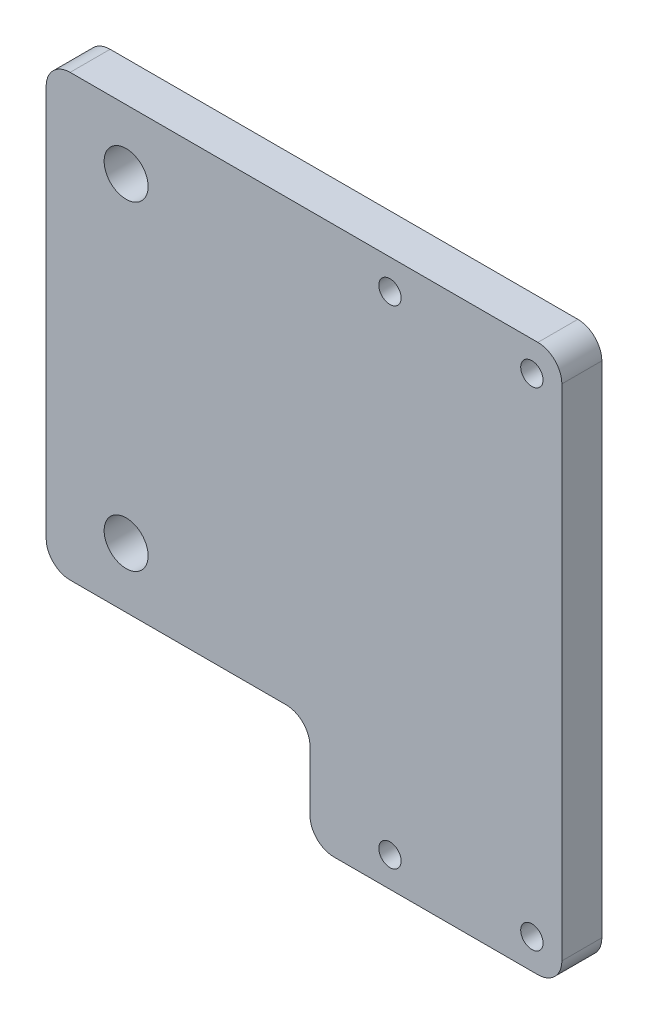
ISO-10303-21;
HEADER;
FILE_DESCRIPTION(('STEP AP214'),'2;1');
FILE_NAME('part.step','',(''),(''),'','','');
FILE_SCHEMA(('AUTOMOTIVE_DESIGN { 1 0 10303 214 1 1 1 1 }'));
ENDSEC;
DATA;
#1=APPLICATION_CONTEXT('core data for automotive mechanical design processes');
#2=APPLICATION_PROTOCOL_DEFINITION('international standard','automotive_design',2000,#1);
#3=PRODUCT_CONTEXT('',#1,'mechanical');
#4=PRODUCT('Part','Part','',(#3));
#5=PRODUCT_RELATED_PRODUCT_CATEGORY('part','',(#4));
#6=PRODUCT_DEFINITION_FORMATION('','',#4);
#7=PRODUCT_DEFINITION_CONTEXT('part definition',#1,'design');
#8=PRODUCT_DEFINITION('design','',#6,#7);
#9=PRODUCT_DEFINITION_SHAPE('','',#8);
#10=(LENGTH_UNIT() NAMED_UNIT(*) SI_UNIT(.MILLI.,.METRE.));
#11=(NAMED_UNIT(*) PLANE_ANGLE_UNIT() SI_UNIT($,.RADIAN.));
#12=(NAMED_UNIT(*) SI_UNIT($,.STERADIAN.) SOLID_ANGLE_UNIT());
#13=UNCERTAINTY_MEASURE_WITH_UNIT(LENGTH_MEASURE(1.E-05),#10,'distance_accuracy_value','');
#14=(GEOMETRIC_REPRESENTATION_CONTEXT(3) GLOBAL_UNCERTAINTY_ASSIGNED_CONTEXT((#13)) GLOBAL_UNIT_ASSIGNED_CONTEXT((#10,
#11,#12)) REPRESENTATION_CONTEXT('',''));
#15=CARTESIAN_POINT('',(0.,0.,0.));
#16=DIRECTION('',(0.,0.,1.));
#17=DIRECTION('',(1.,0.,0.));
#18=AXIS2_PLACEMENT_3D('',#15,#16,#17);
#19=CARTESIAN_POINT('',(-33.,27.5,5.));
#20=DIRECTION('',(1.,0.,0.));
#21=DIRECTION('',(0.,0.,-1.));
#22=AXIS2_PLACEMENT_3D('',#19,#20,#21);
#23=PLANE('',#22);
#24=DIRECTION('',(0.,-1.,0.));
#25=VECTOR('',#24,1.);
#26=CARTESIAN_POINT('',(-33.,27.5,0.));
#27=LINE('',#26,#25);
#28=CARTESIAN_POINT('',(-33.,24.5,0.));
#29=VERTEX_POINT('',#28);
#30=CARTESIAN_POINT('',(-33.,-24.5,0.));
#31=VERTEX_POINT('',#30);
#32=EDGE_CURVE('E208',#29,#31,#27,.T.);
#33=ORIENTED_EDGE('',*,*,#32,.T.);
#34=DIRECTION('',(0.,0.,-1.));
#35=VECTOR('',#34,1.);
#36=CARTESIAN_POINT('',(-33.,-24.5,5.));
#37=LINE('',#36,#35);
#38=CARTESIAN_POINT('',(-33.,-24.5,5.));
#39=VERTEX_POINT('',#38);
#40=EDGE_CURVE('E193',#31,#39,#37,.F.);
#41=ORIENTED_EDGE('',*,*,#40,.T.);
#42=DIRECTION('',(0.,-1.,0.));
#43=VECTOR('',#42,1.);
#44=CARTESIAN_POINT('',(-33.,27.5,5.));
#45=LINE('',#44,#43);
#46=CARTESIAN_POINT('',(-33.,24.5,5.));
#47=VERTEX_POINT('',#46);
#48=EDGE_CURVE('E150',#47,#39,#45,.T.);
#49=ORIENTED_EDGE('',*,*,#48,.F.);
#50=DIRECTION('',(0.,0.,-1.));
#51=VECTOR('',#50,1.);
#52=CARTESIAN_POINT('',(-33.,24.5,5.));
#53=LINE('',#52,#51);
#54=EDGE_CURVE('E190',#47,#29,#53,.T.);
#55=ORIENTED_EDGE('',*,*,#54,.T.);
#56=EDGE_LOOP('',(#33,#41,#49,#55));
#57=FACE_BOUND('',#56,.T.);
#58=ADVANCED_FACE('F32',(#57),#23,.F.);
#59=CARTESIAN_POINT('',(-33.,-27.5,5.));
#60=DIRECTION('',(0.,1.,0.));
#61=DIRECTION('',(-1.,0.,0.));
#62=AXIS2_PLACEMENT_3D('',#59,#60,#61);
#63=PLANE('',#62);
#64=DIRECTION('',(1.,0.,0.));
#65=VECTOR('',#64,1.);
#66=CARTESIAN_POINT('',(-33.,-27.5,0.));
#67=LINE('',#66,#65);
#68=CARTESIAN_POINT('',(-30.,-27.5,0.));
#69=VERTEX_POINT('',#68);
#70=CARTESIAN_POINT('',(-3.,-27.5,0.));
#71=VERTEX_POINT('',#70);
#72=EDGE_CURVE('E197',#69,#71,#67,.T.);
#73=ORIENTED_EDGE('',*,*,#72,.T.);
#74=DIRECTION('',(0.,0.,-1.));
#75=VECTOR('',#74,1.);
#76=CARTESIAN_POINT('',(-3.,-27.5,5.));
#77=LINE('',#76,#75);
#78=CARTESIAN_POINT('',(-3.,-27.5,5.));
#79=VERTEX_POINT('',#78);
#80=EDGE_CURVE('E188',#71,#79,#77,.F.);
#81=ORIENTED_EDGE('',*,*,#80,.T.);
#82=DIRECTION('',(1.,0.,0.));
#83=VECTOR('',#82,1.);
#84=CARTESIAN_POINT('',(-33.,-27.5,5.));
#85=LINE('',#84,#83);
#86=CARTESIAN_POINT('',(-30.,-27.5,5.));
#87=VERTEX_POINT('',#86);
#88=EDGE_CURVE('E216',#87,#79,#85,.T.);
#89=ORIENTED_EDGE('',*,*,#88,.F.);
#90=DIRECTION('',(0.,0.,-1.));
#91=VECTOR('',#90,1.);
#92=CARTESIAN_POINT('',(-30.,-27.5,5.));
#93=LINE('',#92,#91);
#94=EDGE_CURVE('E185',#87,#69,#93,.T.);
#95=ORIENTED_EDGE('',*,*,#94,.T.);
#96=EDGE_LOOP('',(#73,#81,#89,#95));
#97=FACE_BOUND('',#96,.T.);
#98=ADVANCED_FACE('F204',(#97),#63,.F.);
#99=CARTESIAN_POINT('',(0.,-27.5,5.));
#100=DIRECTION('',(1.,0.,0.));
#101=DIRECTION('',(0.,1.,0.));
#102=AXIS2_PLACEMENT_3D('',#99,#100,#101);
#103=PLANE('',#102);
#104=DIRECTION('',(0.,-1.,0.));
#105=VECTOR('',#104,1.);
#106=CARTESIAN_POINT('',(0.,-27.5,0.));
#107=LINE('',#106,#105);
#108=CARTESIAN_POINT('',(0.,-30.5,0.));
#109=VERTEX_POINT('',#108);
#110=CARTESIAN_POINT('',(0.,-37.995,0.));
#111=VERTEX_POINT('',#110);
#112=EDGE_CURVE('E199',#109,#111,#107,.T.);
#113=ORIENTED_EDGE('',*,*,#112,.T.);
#114=DIRECTION('',(0.,0.,-1.));
#115=VECTOR('',#114,1.);
#116=CARTESIAN_POINT('',(0.,-37.995,5.));
#117=LINE('',#116,#115);
#118=CARTESIAN_POINT('',(0.,-37.995,5.));
#119=VERTEX_POINT('',#118);
#120=EDGE_CURVE('E183',#111,#119,#117,.F.);
#121=ORIENTED_EDGE('',*,*,#120,.T.);
#122=DIRECTION('',(0.,-1.,0.));
#123=VECTOR('',#122,1.);
#124=CARTESIAN_POINT('',(0.,-27.5,5.));
#125=LINE('',#124,#123);
#126=CARTESIAN_POINT('',(0.,-30.5,5.));
#127=VERTEX_POINT('',#126);
#128=EDGE_CURVE('E215',#127,#119,#125,.T.);
#129=ORIENTED_EDGE('',*,*,#128,.F.);
#130=DIRECTION('',(0.,0.,-1.));
#131=VECTOR('',#130,1.);
#132=CARTESIAN_POINT('',(0.,-30.5,0.));
#133=LINE('',#132,#131);
#134=EDGE_CURVE('E180',#127,#109,#133,.T.);
#135=ORIENTED_EDGE('',*,*,#134,.T.);
#136=EDGE_LOOP('',(#113,#121,#129,#135));
#137=FACE_BOUND('',#136,.T.);
#138=ADVANCED_FACE('F218',(#137),#103,.F.);
#139=CARTESIAN_POINT('',(31.5,-40.995,5.));
#140=DIRECTION('',(0.,1.,0.));
#141=DIRECTION('',(0.,0.,1.));
#142=AXIS2_PLACEMENT_3D('',#139,#140,#141);
#143=PLANE('',#142);
#144=DIRECTION('',(1.,0.,0.));
#145=VECTOR('',#144,1.);
#146=CARTESIAN_POINT('',(31.5,-40.995,0.));
#147=LINE('',#146,#145);
#148=CARTESIAN_POINT('',(3.,-40.995,0.));
#149=VERTEX_POINT('',#148);
#150=CARTESIAN_POINT('',(28.5,-40.995,0.));
#151=VERTEX_POINT('',#150);
#152=EDGE_CURVE('E152',#149,#151,#147,.T.);
#153=ORIENTED_EDGE('',*,*,#152,.T.);
#154=DIRECTION('',(0.,0.,-1.));
#155=VECTOR('',#154,1.);
#156=CARTESIAN_POINT('',(28.5,-40.995,5.));
#157=LINE('',#156,#155);
#158=CARTESIAN_POINT('',(28.5,-40.995,5.));
#159=VERTEX_POINT('',#158);
#160=EDGE_CURVE('E47',#151,#159,#157,.F.);
#161=ORIENTED_EDGE('',*,*,#160,.T.);
#162=DIRECTION('',(1.,0.,0.));
#163=VECTOR('',#162,1.);
#164=CARTESIAN_POINT('',(0.,-40.995,5.));
#165=LINE('',#164,#163);
#166=CARTESIAN_POINT('',(3.,-40.995,5.));
#167=VERTEX_POINT('',#166);
#168=EDGE_CURVE('E220',#167,#159,#165,.T.);
#169=ORIENTED_EDGE('',*,*,#168,.F.);
#170=DIRECTION('',(0.,0.,-1.));
#171=VECTOR('',#170,1.);
#172=CARTESIAN_POINT('',(3.,-40.995,5.));
#173=LINE('',#172,#171);
#174=EDGE_CURVE('E176',#167,#149,#173,.T.);
#175=ORIENTED_EDGE('',*,*,#174,.T.);
#176=EDGE_LOOP('',(#153,#161,#169,#175));
#177=FACE_BOUND('',#176,.T.);
#178=ADVANCED_FACE('F231',(#177),#143,.F.);
#179=CARTESIAN_POINT('',(31.5,27.5,5.));
#180=DIRECTION('',(-1.,0.,0.));
#181=DIRECTION('',(0.,0.,1.));
#182=AXIS2_PLACEMENT_3D('',#179,#180,#181);
#183=PLANE('',#182);
#184=DIRECTION('',(0.,1.,0.));
#185=VECTOR('',#184,1.);
#186=CARTESIAN_POINT('',(31.5,27.5,0.));
#187=LINE('',#186,#185);
#188=CARTESIAN_POINT('',(31.5,-37.995,0.));
#189=VERTEX_POINT('',#188);
#190=CARTESIAN_POINT('',(31.5,24.5,0.));
#191=VERTEX_POINT('',#190);
#192=EDGE_CURVE('E148',#189,#191,#187,.T.);
#193=ORIENTED_EDGE('',*,*,#192,.T.);
#194=DIRECTION('',(0.,0.,-1.));
#195=VECTOR('',#194,1.);
#196=CARTESIAN_POINT('',(31.5,24.5,5.));
#197=LINE('',#196,#195);
#198=CARTESIAN_POINT('',(31.5,24.5,5.));
#199=VERTEX_POINT('',#198);
#200=EDGE_CURVE('E127',#191,#199,#197,.F.);
#201=ORIENTED_EDGE('',*,*,#200,.T.);
#202=DIRECTION('',(0.,1.,0.));
#203=VECTOR('',#202,1.);
#204=CARTESIAN_POINT('',(31.5,27.5,5.));
#205=LINE('',#204,#203);
#206=CARTESIAN_POINT('',(31.5,-37.995,5.));
#207=VERTEX_POINT('',#206);
#208=EDGE_CURVE('E156',#207,#199,#205,.T.);
#209=ORIENTED_EDGE('',*,*,#208,.F.);
#210=DIRECTION('',(0.,0.,-1.));
#211=VECTOR('',#210,1.);
#212=CARTESIAN_POINT('',(31.5,-37.995,5.));
#213=LINE('',#212,#211);
#214=EDGE_CURVE('E132',#207,#189,#213,.T.);
#215=ORIENTED_EDGE('',*,*,#214,.T.);
#216=EDGE_LOOP('',(#193,#201,#209,#215));
#217=FACE_BOUND('',#216,.T.);
#218=ADVANCED_FACE('F239',(#217),#183,.F.);
#219=CARTESIAN_POINT('',(24.,27.5,5.));
#220=DIRECTION('',(0.,-1.,0.));
#221=DIRECTION('',(0.,0.,-1.));
#222=AXIS2_PLACEMENT_3D('',#219,#220,#221);
#223=PLANE('',#222);
#224=DIRECTION('',(-1.,0.,0.));
#225=VECTOR('',#224,1.);
#226=CARTESIAN_POINT('',(0.,27.5,5.));
#227=LINE('',#226,#225);
#228=CARTESIAN_POINT('',(28.5,27.5,5.));
#229=VERTEX_POINT('',#228);
#230=CARTESIAN_POINT('',(-30.,27.5,5.));
#231=VERTEX_POINT('',#230);
#232=EDGE_CURVE('E142',#229,#231,#227,.T.);
#233=ORIENTED_EDGE('',*,*,#232,.F.);
#234=DIRECTION('',(0.,0.,-1.));
#235=VECTOR('',#234,1.);
#236=CARTESIAN_POINT('',(28.5,27.5,5.));
#237=LINE('',#236,#235);
#238=CARTESIAN_POINT('',(28.5,27.5,0.));
#239=VERTEX_POINT('',#238);
#240=EDGE_CURVE('E126',#229,#239,#237,.T.);
#241=ORIENTED_EDGE('',*,*,#240,.T.);
#242=DIRECTION('',(-1.,0.,0.));
#243=VECTOR('',#242,1.);
#244=CARTESIAN_POINT('',(24.,27.5,0.));
#245=LINE('',#244,#243);
#246=CARTESIAN_POINT('',(-30.,27.5,0.));
#247=VERTEX_POINT('',#246);
#248=EDGE_CURVE('E139',#239,#247,#245,.T.);
#249=ORIENTED_EDGE('',*,*,#248,.T.);
#250=DIRECTION('',(0.,0.,-1.));
#251=VECTOR('',#250,1.);
#252=CARTESIAN_POINT('',(-30.,27.5,5.));
#253=LINE('',#252,#251);
#254=EDGE_CURVE('E144',#247,#231,#253,.F.);
#255=ORIENTED_EDGE('',*,*,#254,.T.);
#256=EDGE_LOOP('',(#233,#241,#249,#255));
#257=FACE_BOUND('',#256,.T.);
#258=ADVANCED_FACE('F138',(#257),#223,.F.);
#259=CARTESIAN_POINT('',(0.,0.,5.));
#260=DIRECTION('',(0.,0.,-1.));
#261=DIRECTION('',(-1.,0.,0.));
#262=AXIS2_PLACEMENT_3D('',#259,#260,#261);
#263=PLANE('',#262);
#264=CARTESIAN_POINT('',(10.,23.75,5.));
#265=DIRECTION('',(0.,0.,1.));
#266=DIRECTION('',(1.,0.,0.));
#267=AXIS2_PLACEMENT_3D('',#264,#265,#266);
#268=CIRCLE('',#267,1.397);
#269=CARTESIAN_POINT('',(11.397,23.75,5.));
#270=VERTEX_POINT('',#269);
#271=EDGE_CURVE('E314',#270,#270,#268,.T.);
#272=ORIENTED_EDGE('',*,*,#271,.F.);
#273=EDGE_LOOP('',(#272));
#274=FACE_BOUND('',#273,.T.);
#275=CARTESIAN_POINT('',(27.75,23.75,5.));
#276=DIRECTION('',(0.,0.,1.));
#277=DIRECTION('',(1.,0.,0.));
#278=AXIS2_PLACEMENT_3D('',#275,#276,#277);
#279=CIRCLE('',#278,1.397);
#280=CARTESIAN_POINT('',(29.147,23.75,5.));
#281=VERTEX_POINT('',#280);
#282=EDGE_CURVE('E308',#281,#281,#279,.T.);
#283=ORIENTED_EDGE('',*,*,#282,.F.);
#284=EDGE_LOOP('',(#283));
#285=FACE_BOUND('',#284,.T.);
#286=CARTESIAN_POINT('',(27.75,-37.245,5.));
#287=DIRECTION('',(0.,0.,1.));
#288=DIRECTION('',(1.,0.,0.));
#289=AXIS2_PLACEMENT_3D('',#286,#287,#288);
#290=CIRCLE('',#289,1.397);
#291=CARTESIAN_POINT('',(29.147,-37.245,5.));
#292=VERTEX_POINT('',#291);
#293=EDGE_CURVE('E302',#292,#292,#290,.T.);
#294=ORIENTED_EDGE('',*,*,#293,.F.);
#295=EDGE_LOOP('',(#294));
#296=FACE_BOUND('',#295,.T.);
#297=CARTESIAN_POINT('',(10.,-37.245,5.));
#298=DIRECTION('',(0.,0.,1.));
#299=DIRECTION('',(1.,0.,0.));
#300=AXIS2_PLACEMENT_3D('',#297,#298,#299);
#301=CIRCLE('',#300,1.397);
#302=CARTESIAN_POINT('',(11.397,-37.245,5.));
#303=VERTEX_POINT('',#302);
#304=EDGE_CURVE('E296',#303,#303,#301,.T.);
#305=ORIENTED_EDGE('',*,*,#304,.F.);
#306=EDGE_LOOP('',(#305));
#307=FACE_BOUND('',#306,.T.);
#308=CARTESIAN_POINT('',(-23.,-20.,5.));
#309=DIRECTION('',(0.,0.,-1.));
#310=DIRECTION('',(-1.,0.,0.));
#311=AXIS2_PLACEMENT_3D('',#308,#309,#310);
#312=CIRCLE('',#311,2.75);
#313=CARTESIAN_POINT('',(-25.75,-20.,5.));
#314=VERTEX_POINT('',#313);
#315=EDGE_CURVE('E287',#314,#314,#312,.T.);
#316=ORIENTED_EDGE('',*,*,#315,.T.);
#317=EDGE_LOOP('',(#316));
#318=FACE_BOUND('',#317,.T.);
#319=CARTESIAN_POINT('',(-23.,20.,5.));
#320=DIRECTION('',(0.,0.,-1.));
#321=DIRECTION('',(-1.,0.,0.));
#322=AXIS2_PLACEMENT_3D('',#319,#320,#321);
#323=CIRCLE('',#322,2.75);
#324=CARTESIAN_POINT('',(-25.75,20.,5.));
#325=VERTEX_POINT('',#324);
#326=EDGE_CURVE('E228',#325,#325,#323,.T.);
#327=ORIENTED_EDGE('',*,*,#326,.T.);
#328=EDGE_LOOP('',(#327));
#329=FACE_BOUND('',#328,.T.);
#330=ORIENTED_EDGE('',*,*,#208,.T.);
#331=CARTESIAN_POINT('',(28.5,24.5,5.));
#332=DIRECTION('',(0.,0.,-1.));
#333=DIRECTION('',(-1.,0.,0.));
#334=AXIS2_PLACEMENT_3D('',#331,#332,#333);
#335=CIRCLE('',#334,3.);
#336=EDGE_CURVE('E174',#199,#229,#335,.F.);
#337=ORIENTED_EDGE('',*,*,#336,.T.);
#338=ORIENTED_EDGE('',*,*,#232,.T.);
#339=CARTESIAN_POINT('',(-30.,24.5,5.));
#340=DIRECTION('',(0.,0.,-1.));
#341=DIRECTION('',(-1.,0.,0.));
#342=AXIS2_PLACEMENT_3D('',#339,#340,#341);
#343=CIRCLE('',#342,3.);
#344=EDGE_CURVE('E167',#231,#47,#343,.F.);
#345=ORIENTED_EDGE('',*,*,#344,.T.);
#346=ORIENTED_EDGE('',*,*,#48,.T.);
#347=CARTESIAN_POINT('',(-30.,-24.5,5.));
#348=DIRECTION('',(0.,0.,-1.));
#349=DIRECTION('',(-1.,0.,0.));
#350=AXIS2_PLACEMENT_3D('',#347,#348,#349);
#351=CIRCLE('',#350,3.);
#352=EDGE_CURVE('E169',#39,#87,#351,.F.);
#353=ORIENTED_EDGE('',*,*,#352,.T.);
#354=ORIENTED_EDGE('',*,*,#88,.T.);
#355=CARTESIAN_POINT('',(-3.,-30.5,5.));
#356=DIRECTION('',(0.,0.,-1.));
#357=DIRECTION('',(-1.,0.,0.));
#358=AXIS2_PLACEMENT_3D('',#355,#356,#357);
#359=CIRCLE('',#358,3.);
#360=EDGE_CURVE('E11',#79,#127,#359,.T.);
#361=ORIENTED_EDGE('',*,*,#360,.T.);
#362=ORIENTED_EDGE('',*,*,#128,.T.);
#363=CARTESIAN_POINT('',(3.,-37.995,5.));
#364=DIRECTION('',(0.,0.,-1.));
#365=DIRECTION('',(-1.,0.,0.));
#366=AXIS2_PLACEMENT_3D('',#363,#364,#365);
#367=CIRCLE('',#366,3.);
#368=EDGE_CURVE('E54',#119,#167,#367,.F.);
#369=ORIENTED_EDGE('',*,*,#368,.T.);
#370=ORIENTED_EDGE('',*,*,#168,.T.);
#371=CARTESIAN_POINT('',(28.5,-37.995,5.));
#372=DIRECTION('',(0.,0.,-1.));
#373=DIRECTION('',(-1.,0.,0.));
#374=AXIS2_PLACEMENT_3D('',#371,#372,#373);
#375=CIRCLE('',#374,3.);
#376=EDGE_CURVE('E172',#159,#207,#375,.F.);
#377=ORIENTED_EDGE('',*,*,#376,.T.);
#378=EDGE_LOOP('',(#330,#337,#338,#345,#346,#353,#354,#361,#362,#369,#370,#377));
#379=FACE_BOUND('',#378,.T.);
#380=ADVANCED_FACE('F214',(#274,#285,#296,#307,#318,#329,#379),#263,.F.);
#381=CARTESIAN_POINT('',(0.,0.,0.));
#382=DIRECTION('',(0.,0.,-1.));
#383=DIRECTION('',(-1.,0.,0.));
#384=AXIS2_PLACEMENT_3D('',#381,#382,#383);
#385=PLANE('',#384);
#386=CARTESIAN_POINT('',(10.,23.75,0.));
#387=DIRECTION('',(0.,0.,1.));
#388=DIRECTION('',(1.,0.,0.));
#389=AXIS2_PLACEMENT_3D('',#386,#387,#388);
#390=CIRCLE('',#389,1.397);
#391=CARTESIAN_POINT('',(11.397,23.75,0.));
#392=VERTEX_POINT('',#391);
#393=EDGE_CURVE('E311',#392,#392,#390,.T.);
#394=ORIENTED_EDGE('',*,*,#393,.T.);
#395=EDGE_LOOP('',(#394));
#396=FACE_BOUND('',#395,.T.);
#397=CARTESIAN_POINT('',(27.75,23.75,0.));
#398=DIRECTION('',(0.,0.,1.));
#399=DIRECTION('',(1.,0.,0.));
#400=AXIS2_PLACEMENT_3D('',#397,#398,#399);
#401=CIRCLE('',#400,1.397);
#402=CARTESIAN_POINT('',(29.147,23.75,0.));
#403=VERTEX_POINT('',#402);
#404=EDGE_CURVE('E305',#403,#403,#401,.T.);
#405=ORIENTED_EDGE('',*,*,#404,.T.);
#406=EDGE_LOOP('',(#405));
#407=FACE_BOUND('',#406,.T.);
#408=CARTESIAN_POINT('',(27.75,-37.245,0.));
#409=DIRECTION('',(0.,0.,1.));
#410=DIRECTION('',(1.,0.,0.));
#411=AXIS2_PLACEMENT_3D('',#408,#409,#410);
#412=CIRCLE('',#411,1.397);
#413=CARTESIAN_POINT('',(29.147,-37.245,0.));
#414=VERTEX_POINT('',#413);
#415=EDGE_CURVE('E299',#414,#414,#412,.T.);
#416=ORIENTED_EDGE('',*,*,#415,.T.);
#417=EDGE_LOOP('',(#416));
#418=FACE_BOUND('',#417,.T.);
#419=CARTESIAN_POINT('',(10.,-37.245,0.));
#420=DIRECTION('',(0.,0.,1.));
#421=DIRECTION('',(1.,0.,0.));
#422=AXIS2_PLACEMENT_3D('',#419,#420,#421);
#423=CIRCLE('',#422,1.397);
#424=CARTESIAN_POINT('',(11.397,-37.245,0.));
#425=VERTEX_POINT('',#424);
#426=EDGE_CURVE('E293',#425,#425,#423,.T.);
#427=ORIENTED_EDGE('',*,*,#426,.T.);
#428=EDGE_LOOP('',(#427));
#429=FACE_BOUND('',#428,.T.);
#430=CARTESIAN_POINT('',(-23.,-20.,0.));
#431=DIRECTION('',(0.,0.,-1.));
#432=DIRECTION('',(-1.,0.,0.));
#433=AXIS2_PLACEMENT_3D('',#430,#431,#432);
#434=CIRCLE('',#433,2.75);
#435=CARTESIAN_POINT('',(-25.75,-20.,0.));
#436=VERTEX_POINT('',#435);
#437=EDGE_CURVE('E290',#436,#436,#434,.T.);
#438=ORIENTED_EDGE('',*,*,#437,.F.);
#439=EDGE_LOOP('',(#438));
#440=FACE_BOUND('',#439,.T.);
#441=CARTESIAN_POINT('',(-23.,20.,0.));
#442=DIRECTION('',(0.,0.,-1.));
#443=DIRECTION('',(-1.,0.,0.));
#444=AXIS2_PLACEMENT_3D('',#441,#442,#443);
#445=CIRCLE('',#444,2.75);
#446=CARTESIAN_POINT('',(-25.75,20.,0.));
#447=VERTEX_POINT('',#446);
#448=EDGE_CURVE('E284',#447,#447,#445,.T.);
#449=ORIENTED_EDGE('',*,*,#448,.F.);
#450=EDGE_LOOP('',(#449));
#451=FACE_BOUND('',#450,.T.);
#452=ORIENTED_EDGE('',*,*,#248,.F.);
#453=CARTESIAN_POINT('',(28.5,24.5,0.));
#454=DIRECTION('',(0.,0.,-1.));
#455=DIRECTION('',(-1.,0.,0.));
#456=AXIS2_PLACEMENT_3D('',#453,#454,#455);
#457=CIRCLE('',#456,3.);
#458=EDGE_CURVE('E122',#239,#191,#457,.T.);
#459=ORIENTED_EDGE('',*,*,#458,.T.);
#460=ORIENTED_EDGE('',*,*,#192,.F.);
#461=CARTESIAN_POINT('',(28.5,-37.995,0.));
#462=DIRECTION('',(0.,0.,-1.));
#463=DIRECTION('',(-1.,0.,0.));
#464=AXIS2_PLACEMENT_3D('',#461,#462,#463);
#465=CIRCLE('',#464,3.);
#466=EDGE_CURVE('E133',#189,#151,#465,.T.);
#467=ORIENTED_EDGE('',*,*,#466,.T.);
#468=ORIENTED_EDGE('',*,*,#152,.F.);
#469=CARTESIAN_POINT('',(3.,-37.995,0.));
#470=DIRECTION('',(0.,0.,-1.));
#471=DIRECTION('',(-1.,0.,0.));
#472=AXIS2_PLACEMENT_3D('',#469,#470,#471);
#473=CIRCLE('',#472,3.);
#474=EDGE_CURVE('E161',#149,#111,#473,.T.);
#475=ORIENTED_EDGE('',*,*,#474,.T.);
#476=ORIENTED_EDGE('',*,*,#112,.F.);
#477=CARTESIAN_POINT('',(-3.,-30.5,0.));
#478=DIRECTION('',(0.,0.,-1.));
#479=DIRECTION('',(-1.,0.,0.));
#480=AXIS2_PLACEMENT_3D('',#477,#478,#479);
#481=CIRCLE('',#480,3.);
#482=EDGE_CURVE('E40',#109,#71,#481,.F.);
#483=ORIENTED_EDGE('',*,*,#482,.T.);
#484=ORIENTED_EDGE('',*,*,#72,.F.);
#485=CARTESIAN_POINT('',(-30.,-24.5,0.));
#486=DIRECTION('',(0.,0.,-1.));
#487=DIRECTION('',(-1.,0.,0.));
#488=AXIS2_PLACEMENT_3D('',#485,#486,#487);
#489=CIRCLE('',#488,3.);
#490=EDGE_CURVE('E159',#69,#31,#489,.T.);
#491=ORIENTED_EDGE('',*,*,#490,.T.);
#492=ORIENTED_EDGE('',*,*,#32,.F.);
#493=CARTESIAN_POINT('',(-30.,24.5,0.));
#494=DIRECTION('',(0.,0.,-1.));
#495=DIRECTION('',(-1.,0.,0.));
#496=AXIS2_PLACEMENT_3D('',#493,#494,#495);
#497=CIRCLE('',#496,3.);
#498=EDGE_CURVE('E143',#29,#247,#497,.T.);
#499=ORIENTED_EDGE('',*,*,#498,.T.);
#500=EDGE_LOOP('',(#452,#459,#460,#467,#468,#475,#476,#483,#484,#491,#492,#499));
#501=FACE_BOUND('',#500,.T.);
#502=ADVANCED_FACE('F146',(#396,#407,#418,#429,#440,#451,#501),#385,.T.);
#503=CARTESIAN_POINT('',(-23.,20.,0.));
#504=DIRECTION('',(0.,0.,-1.));
#505=DIRECTION('',(-1.,0.,0.));
#506=AXIS2_PLACEMENT_3D('',#503,#504,#505);
#507=CYLINDRICAL_SURFACE('',#506,2.75);
#508=ORIENTED_EDGE('',*,*,#326,.F.);
#509=EDGE_LOOP('',(#508));
#510=FACE_BOUND('',#509,.T.);
#511=ORIENTED_EDGE('',*,*,#448,.T.);
#512=EDGE_LOOP('',(#511));
#513=FACE_BOUND('',#512,.T.);
#514=ADVANCED_FACE('F333',(#510,#513),#507,.F.);
#515=CARTESIAN_POINT('',(-23.,-20.,0.));
#516=DIRECTION('',(0.,0.,-1.));
#517=DIRECTION('',(-1.,0.,0.));
#518=AXIS2_PLACEMENT_3D('',#515,#516,#517);
#519=CYLINDRICAL_SURFACE('',#518,2.75);
#520=ORIENTED_EDGE('',*,*,#315,.F.);
#521=EDGE_LOOP('',(#520));
#522=FACE_BOUND('',#521,.T.);
#523=ORIENTED_EDGE('',*,*,#437,.T.);
#524=EDGE_LOOP('',(#523));
#525=FACE_BOUND('',#524,.T.);
#526=ADVANCED_FACE('F259',(#522,#525),#519,.F.);
#527=CARTESIAN_POINT('',(28.5,24.5,5.));
#528=DIRECTION('',(0.,0.,-1.));
#529=DIRECTION('',(-1.,0.,0.));
#530=AXIS2_PLACEMENT_3D('',#527,#528,#529);
#531=CYLINDRICAL_SURFACE('',#530,3.);
#532=ORIENTED_EDGE('',*,*,#336,.F.);
#533=ORIENTED_EDGE('',*,*,#200,.F.);
#534=ORIENTED_EDGE('',*,*,#458,.F.);
#535=ORIENTED_EDGE('',*,*,#240,.F.);
#536=EDGE_LOOP('',(#532,#533,#534,#535));
#537=FACE_BOUND('',#536,.T.);
#538=ADVANCED_FACE('F125',(#537),#531,.T.);
#539=CARTESIAN_POINT('',(28.5,-37.995,5.));
#540=DIRECTION('',(0.,0.,-1.));
#541=DIRECTION('',(-1.,0.,0.));
#542=AXIS2_PLACEMENT_3D('',#539,#540,#541);
#543=CYLINDRICAL_SURFACE('',#542,3.);
#544=ORIENTED_EDGE('',*,*,#376,.F.);
#545=ORIENTED_EDGE('',*,*,#160,.F.);
#546=ORIENTED_EDGE('',*,*,#466,.F.);
#547=ORIENTED_EDGE('',*,*,#214,.F.);
#548=EDGE_LOOP('',(#544,#545,#546,#547));
#549=FACE_BOUND('',#548,.T.);
#550=ADVANCED_FACE('F235',(#549),#543,.T.);
#551=CARTESIAN_POINT('',(3.,-37.995,5.));
#552=DIRECTION('',(0.,0.,-1.));
#553=DIRECTION('',(-1.,0.,0.));
#554=AXIS2_PLACEMENT_3D('',#551,#552,#553);
#555=CYLINDRICAL_SURFACE('',#554,3.);
#556=ORIENTED_EDGE('',*,*,#368,.F.);
#557=ORIENTED_EDGE('',*,*,#120,.F.);
#558=ORIENTED_EDGE('',*,*,#474,.F.);
#559=ORIENTED_EDGE('',*,*,#174,.F.);
#560=EDGE_LOOP('',(#556,#557,#558,#559));
#561=FACE_BOUND('',#560,.T.);
#562=ADVANCED_FACE('F262',(#561),#555,.T.);
#563=CARTESIAN_POINT('',(-3.,-30.5,5.));
#564=DIRECTION('',(0.,0.,1.));
#565=DIRECTION('',(1.,0.,0.));
#566=AXIS2_PLACEMENT_3D('',#563,#564,#565);
#567=CYLINDRICAL_SURFACE('',#566,3.);
#568=ORIENTED_EDGE('',*,*,#360,.F.);
#569=ORIENTED_EDGE('',*,*,#80,.F.);
#570=ORIENTED_EDGE('',*,*,#482,.F.);
#571=ORIENTED_EDGE('',*,*,#134,.F.);
#572=EDGE_LOOP('',(#568,#569,#570,#571));
#573=FACE_BOUND('',#572,.T.);
#574=ADVANCED_FACE('F211',(#573),#567,.F.);
#575=CARTESIAN_POINT('',(-30.,-24.5,5.));
#576=DIRECTION('',(0.,0.,-1.));
#577=DIRECTION('',(-1.,0.,0.));
#578=AXIS2_PLACEMENT_3D('',#575,#576,#577);
#579=CYLINDRICAL_SURFACE('',#578,3.);
#580=ORIENTED_EDGE('',*,*,#352,.F.);
#581=ORIENTED_EDGE('',*,*,#40,.F.);
#582=ORIENTED_EDGE('',*,*,#490,.F.);
#583=ORIENTED_EDGE('',*,*,#94,.F.);
#584=EDGE_LOOP('',(#580,#581,#582,#583));
#585=FACE_BOUND('',#584,.T.);
#586=ADVANCED_FACE('F267',(#585),#579,.T.);
#587=CARTESIAN_POINT('',(-30.,24.5,5.));
#588=DIRECTION('',(0.,0.,-1.));
#589=DIRECTION('',(-1.,0.,0.));
#590=AXIS2_PLACEMENT_3D('',#587,#588,#589);
#591=CYLINDRICAL_SURFACE('',#590,3.);
#592=ORIENTED_EDGE('',*,*,#344,.F.);
#593=ORIENTED_EDGE('',*,*,#254,.F.);
#594=ORIENTED_EDGE('',*,*,#498,.F.);
#595=ORIENTED_EDGE('',*,*,#54,.F.);
#596=EDGE_LOOP('',(#592,#593,#594,#595));
#597=FACE_BOUND('',#596,.T.);
#598=ADVANCED_FACE('F34',(#597),#591,.T.);
#599=CARTESIAN_POINT('',(10.,-37.245,5.));
#600=DIRECTION('',(0.,0.,1.));
#601=DIRECTION('',(1.,0.,0.));
#602=AXIS2_PLACEMENT_3D('',#599,#600,#601);
#603=CYLINDRICAL_SURFACE('',#602,1.397);
#604=ORIENTED_EDGE('',*,*,#426,.F.);
#605=EDGE_LOOP('',(#604));
#606=FACE_BOUND('',#605,.T.);
#607=ORIENTED_EDGE('',*,*,#304,.T.);
#608=EDGE_LOOP('',(#607));
#609=FACE_BOUND('',#608,.T.);
#610=ADVANCED_FACE('F273',(#606,#609),#603,.F.);
#611=CARTESIAN_POINT('',(27.75,-37.245,5.));
#612=DIRECTION('',(0.,0.,1.));
#613=DIRECTION('',(1.,0.,0.));
#614=AXIS2_PLACEMENT_3D('',#611,#612,#613);
#615=CYLINDRICAL_SURFACE('',#614,1.397);
#616=ORIENTED_EDGE('',*,*,#415,.F.);
#617=EDGE_LOOP('',(#616));
#618=FACE_BOUND('',#617,.T.);
#619=ORIENTED_EDGE('',*,*,#293,.T.);
#620=EDGE_LOOP('',(#619));
#621=FACE_BOUND('',#620,.T.);
#622=ADVANCED_FACE('F351',(#618,#621),#615,.F.);
#623=CARTESIAN_POINT('',(27.75,23.75,5.));
#624=DIRECTION('',(0.,0.,1.));
#625=DIRECTION('',(1.,0.,0.));
#626=AXIS2_PLACEMENT_3D('',#623,#624,#625);
#627=CYLINDRICAL_SURFACE('',#626,1.397);
#628=ORIENTED_EDGE('',*,*,#404,.F.);
#629=EDGE_LOOP('',(#628));
#630=FACE_BOUND('',#629,.T.);
#631=ORIENTED_EDGE('',*,*,#282,.T.);
#632=EDGE_LOOP('',(#631));
#633=FACE_BOUND('',#632,.T.);
#634=ADVANCED_FACE('F355',(#630,#633),#627,.F.);
#635=CARTESIAN_POINT('',(10.,23.75,5.));
#636=DIRECTION('',(0.,0.,1.));
#637=DIRECTION('',(1.,0.,0.));
#638=AXIS2_PLACEMENT_3D('',#635,#636,#637);
#639=CYLINDRICAL_SURFACE('',#638,1.397);
#640=ORIENTED_EDGE('',*,*,#393,.F.);
#641=EDGE_LOOP('',(#640));
#642=FACE_BOUND('',#641,.T.);
#643=ORIENTED_EDGE('',*,*,#271,.T.);
#644=EDGE_LOOP('',(#643));
#645=FACE_BOUND('',#644,.T.);
#646=ADVANCED_FACE('F318',(#642,#645),#639,.F.);
#647=CLOSED_SHELL('',(#58,#98,#138,#178,#218,#258,#380,#502,#514,#526,#538,#550,#562,#574,#586,
#598,#610,#622,#634,#646));
#648=MANIFOLD_SOLID_BREP('B2',#647);
#649=ADVANCED_BREP_SHAPE_REPRESENTATION('',(#18,#648),#14);
#650=SHAPE_DEFINITION_REPRESENTATION(#9,#649);
ENDSEC;
END-ISO-10303-21;
